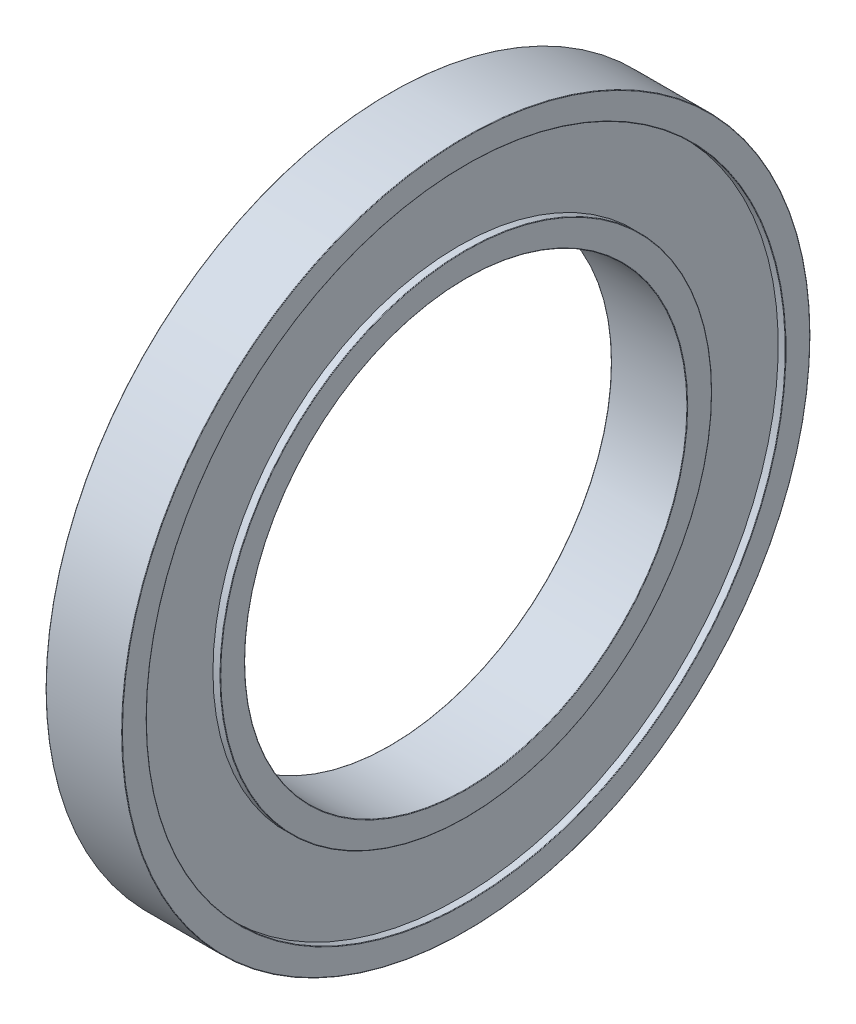
ISO-10303-21;
HEADER;
FILE_DESCRIPTION(('STEP AP214'),'2;1');
FILE_NAME('part.step','',(''),(''),'','','');
FILE_SCHEMA(('AUTOMOTIVE_DESIGN { 1 0 10303 214 1 1 1 1 }'));
ENDSEC;
DATA;
#1=APPLICATION_CONTEXT('core data for automotive mechanical design processes');
#2=APPLICATION_PROTOCOL_DEFINITION('international standard','automotive_design',2000,#1);
#3=PRODUCT_CONTEXT('',#1,'mechanical');
#4=PRODUCT('Part','Part','',(#3));
#5=PRODUCT_RELATED_PRODUCT_CATEGORY('part','',(#4));
#6=PRODUCT_DEFINITION_FORMATION('','',#4);
#7=PRODUCT_DEFINITION_CONTEXT('part definition',#1,'design');
#8=PRODUCT_DEFINITION('design','',#6,#7);
#9=PRODUCT_DEFINITION_SHAPE('','',#8);
#10=(LENGTH_UNIT() NAMED_UNIT(*) SI_UNIT(.MILLI.,.METRE.));
#11=(NAMED_UNIT(*) PLANE_ANGLE_UNIT() SI_UNIT($,.RADIAN.));
#12=(NAMED_UNIT(*) SI_UNIT($,.STERADIAN.) SOLID_ANGLE_UNIT());
#13=UNCERTAINTY_MEASURE_WITH_UNIT(LENGTH_MEASURE(1.E-05),#10,'distance_accuracy_value','');
#14=(GEOMETRIC_REPRESENTATION_CONTEXT(3) GLOBAL_UNCERTAINTY_ASSIGNED_CONTEXT((#13)) GLOBAL_UNIT_ASSIGNED_CONTEXT((#10,
#11,#12)) REPRESENTATION_CONTEXT('',''));
#15=CARTESIAN_POINT('',(0.,0.,0.));
#16=DIRECTION('',(0.,0.,1.));
#17=DIRECTION('',(1.,0.,0.));
#18=AXIS2_PLACEMENT_3D('',#15,#16,#17);
#19=CARTESIAN_POINT('',(0.,0.,0.));
#20=DIRECTION('',(-1.,0.,0.));
#21=DIRECTION('',(0.,0.,1.));
#22=AXIS2_PLACEMENT_3D('',#19,#20,#21);
#23=CYLINDRICAL_SURFACE('',#22,90.);
#24=CARTESIAN_POINT('',(0.2,0.,0.));
#25=DIRECTION('',(1.,0.,0.));
#26=DIRECTION('',(0.,0.,-1.));
#27=AXIS2_PLACEMENT_3D('',#24,#25,#26);
#28=CIRCLE('',#27,90.);
#29=CARTESIAN_POINT('',(0.2,0.,-90.));
#30=VERTEX_POINT('',#29);
#31=EDGE_CURVE('E65',#30,#30,#28,.F.);
#32=ORIENTED_EDGE('',*,*,#31,.T.);
#33=EDGE_LOOP('',(#32));
#34=FACE_BOUND('',#33,.T.);
#35=CARTESIAN_POINT('',(30.8,0.,0.));
#36=DIRECTION('',(-1.,0.,0.));
#37=DIRECTION('',(0.,0.,1.));
#38=AXIS2_PLACEMENT_3D('',#35,#36,#37);
#39=CIRCLE('',#38,90.);
#40=CARTESIAN_POINT('',(30.8,0.,90.));
#41=VERTEX_POINT('',#40);
#42=EDGE_CURVE('E68',#41,#41,#39,.F.);
#43=ORIENTED_EDGE('',*,*,#42,.T.);
#44=EDGE_LOOP('',(#43));
#45=FACE_BOUND('',#44,.T.);
#46=ADVANCED_FACE('F33',(#34,#45),#23,.F.);
#47=CARTESIAN_POINT('',(31.,100.,0.));
#48=DIRECTION('',(-1.,0.,0.));
#49=DIRECTION('',(0.,0.,1.));
#50=AXIS2_PLACEMENT_3D('',#47,#48,#49);
#51=PLANE('',#50);
#52=CARTESIAN_POINT('',(31.,0.,0.));
#53=DIRECTION('',(-1.,0.,0.));
#54=DIRECTION('',(0.,0.,1.));
#55=AXIS2_PLACEMENT_3D('',#52,#53,#54);
#56=CIRCLE('',#55,90.2);
#57=CARTESIAN_POINT('',(31.,0.,90.2));
#58=VERTEX_POINT('',#57);
#59=EDGE_CURVE('E59',#58,#58,#56,.T.);
#60=ORIENTED_EDGE('',*,*,#59,.T.);
#61=EDGE_LOOP('',(#60));
#62=FACE_BOUND('',#61,.T.);
#63=CARTESIAN_POINT('',(31.,0.,0.));
#64=DIRECTION('',(-1.,0.,0.));
#65=DIRECTION('',(0.,0.,1.));
#66=AXIS2_PLACEMENT_3D('',#63,#64,#65);
#67=CIRCLE('',#66,99.8);
#68=CARTESIAN_POINT('',(31.,0.,99.8));
#69=VERTEX_POINT('',#68);
#70=EDGE_CURVE('E62',#69,#69,#67,.F.);
#71=ORIENTED_EDGE('',*,*,#70,.T.);
#72=EDGE_LOOP('',(#71));
#73=FACE_BOUND('',#72,.T.);
#74=ADVANCED_FACE('F122',(#62,#73),#51,.F.);
#75=CARTESIAN_POINT('',(0.,0.,0.));
#76=DIRECTION('',(-1.,0.,0.));
#77=DIRECTION('',(0.,0.,1.));
#78=AXIS2_PLACEMENT_3D('',#75,#76,#77);
#79=CYLINDRICAL_SURFACE('',#78,100.);
#80=CARTESIAN_POINT('',(30.8,0.,0.));
#81=DIRECTION('',(-1.,0.,0.));
#82=DIRECTION('',(0.,0.,1.));
#83=AXIS2_PLACEMENT_3D('',#80,#81,#82);
#84=CIRCLE('',#83,100.);
#85=CARTESIAN_POINT('',(30.8,0.,100.));
#86=VERTEX_POINT('',#85);
#87=EDGE_CURVE('E56',#86,#86,#84,.T.);
#88=ORIENTED_EDGE('',*,*,#87,.T.);
#89=EDGE_LOOP('',(#88));
#90=FACE_BOUND('',#89,.T.);
#91=CARTESIAN_POINT('',(28.,0.,0.));
#92=DIRECTION('',(-1.,0.,0.));
#93=DIRECTION('',(0.,0.,1.));
#94=AXIS2_PLACEMENT_3D('',#91,#92,#93);
#95=CIRCLE('',#94,100.);
#96=CARTESIAN_POINT('',(28.,0.,100.));
#97=VERTEX_POINT('',#96);
#98=EDGE_CURVE('E89',#97,#97,#95,.T.);
#99=ORIENTED_EDGE('',*,*,#98,.F.);
#100=EDGE_LOOP('',(#99));
#101=FACE_BOUND('',#100,.T.);
#102=ADVANCED_FACE('F128',(#90,#101),#79,.T.);
#103=CARTESIAN_POINT('',(28.,130.,0.));
#104=DIRECTION('',(-1.,0.,0.));
#105=DIRECTION('',(0.,0.,1.));
#106=AXIS2_PLACEMENT_3D('',#103,#104,#105);
#107=PLANE('',#106);
#108=CARTESIAN_POINT('',(28.,0.,0.));
#109=DIRECTION('',(-1.,0.,0.));
#110=DIRECTION('',(0.,0.,1.));
#111=AXIS2_PLACEMENT_3D('',#108,#109,#110);
#112=CIRCLE('',#111,130.);
#113=CARTESIAN_POINT('',(28.,0.,130.));
#114=VERTEX_POINT('',#113);
#115=EDGE_CURVE('E92',#114,#114,#112,.T.);
#116=ORIENTED_EDGE('',*,*,#115,.F.);
#117=EDGE_LOOP('',(#116));
#118=FACE_BOUND('',#117,.T.);
#119=ORIENTED_EDGE('',*,*,#98,.T.);
#120=EDGE_LOOP('',(#119));
#121=FACE_BOUND('',#120,.T.);
#122=ADVANCED_FACE('F178',(#118,#121),#107,.F.);
#123=CARTESIAN_POINT('',(0.,0.,0.));
#124=DIRECTION('',(-1.,0.,0.));
#125=DIRECTION('',(0.,0.,1.));
#126=AXIS2_PLACEMENT_3D('',#123,#124,#125);
#127=CYLINDRICAL_SURFACE('',#126,130.);
#128=CARTESIAN_POINT('',(30.8,0.,0.));
#129=DIRECTION('',(-1.,0.,0.));
#130=DIRECTION('',(0.,0.,1.));
#131=AXIS2_PLACEMENT_3D('',#128,#129,#130);
#132=CIRCLE('',#131,130.);
#133=CARTESIAN_POINT('',(30.8,0.,130.));
#134=VERTEX_POINT('',#133);
#135=EDGE_CURVE('E44',#134,#134,#132,.F.);
#136=ORIENTED_EDGE('',*,*,#135,.T.);
#137=EDGE_LOOP('',(#136));
#138=FACE_BOUND('',#137,.T.);
#139=ORIENTED_EDGE('',*,*,#115,.T.);
#140=EDGE_LOOP('',(#139));
#141=FACE_BOUND('',#140,.T.);
#142=ADVANCED_FACE('F170',(#138,#141),#127,.F.);
#143=CARTESIAN_POINT('',(31.,140.,0.));
#144=DIRECTION('',(-1.,0.,0.));
#145=DIRECTION('',(0.,0.,1.));
#146=AXIS2_PLACEMENT_3D('',#143,#144,#145);
#147=PLANE('',#146);
#148=CARTESIAN_POINT('',(31.,0.,0.));
#149=DIRECTION('',(-1.,0.,0.));
#150=DIRECTION('',(0.,0.,1.));
#151=AXIS2_PLACEMENT_3D('',#148,#149,#150);
#152=CIRCLE('',#151,130.2);
#153=CARTESIAN_POINT('',(31.,0.,130.2));
#154=VERTEX_POINT('',#153);
#155=EDGE_CURVE('E48',#154,#154,#152,.T.);
#156=ORIENTED_EDGE('',*,*,#155,.T.);
#157=EDGE_LOOP('',(#156));
#158=FACE_BOUND('',#157,.T.);
#159=CARTESIAN_POINT('',(31.,0.,0.));
#160=DIRECTION('',(-1.,0.,0.));
#161=DIRECTION('',(0.,0.,1.));
#162=AXIS2_PLACEMENT_3D('',#159,#160,#161);
#163=CIRCLE('',#162,139.8);
#164=CARTESIAN_POINT('',(31.,0.,139.8));
#165=VERTEX_POINT('',#164);
#166=EDGE_CURVE('E53',#165,#165,#163,.F.);
#167=ORIENTED_EDGE('',*,*,#166,.T.);
#168=EDGE_LOOP('',(#167));
#169=FACE_BOUND('',#168,.T.);
#170=ADVANCED_FACE('F168',(#158,#169),#147,.F.);
#171=CARTESIAN_POINT('',(0.,0.,0.));
#172=DIRECTION('',(-1.,0.,0.));
#173=DIRECTION('',(0.,0.,1.));
#174=AXIS2_PLACEMENT_3D('',#171,#172,#173);
#175=CYLINDRICAL_SURFACE('',#174,140.);
#176=CARTESIAN_POINT('',(30.8,0.,0.));
#177=DIRECTION('',(-1.,0.,0.));
#178=DIRECTION('',(0.,0.,1.));
#179=AXIS2_PLACEMENT_3D('',#176,#177,#178);
#180=CIRCLE('',#179,140.);
#181=CARTESIAN_POINT('',(30.8,0.,140.));
#182=VERTEX_POINT('',#181);
#183=EDGE_CURVE('E10',#182,#182,#180,.T.);
#184=ORIENTED_EDGE('',*,*,#183,.T.);
#185=EDGE_LOOP('',(#184));
#186=FACE_BOUND('',#185,.T.);
#187=CARTESIAN_POINT('',(0.2,0.,0.));
#188=DIRECTION('',(1.,0.,0.));
#189=DIRECTION('',(0.,0.,-1.));
#190=AXIS2_PLACEMENT_3D('',#187,#188,#189);
#191=CIRCLE('',#190,140.);
#192=CARTESIAN_POINT('',(0.2,0.,-140.));
#193=VERTEX_POINT('',#192);
#194=EDGE_CURVE('E40',#193,#193,#191,.T.);
#195=ORIENTED_EDGE('',*,*,#194,.T.);
#196=EDGE_LOOP('',(#195));
#197=FACE_BOUND('',#196,.T.);
#198=ADVANCED_FACE('F118',(#186,#197),#175,.T.);
#199=CARTESIAN_POINT('',(0.,130.,0.));
#200=DIRECTION('',(1.,0.,0.));
#201=DIRECTION('',(0.,0.,-1.));
#202=AXIS2_PLACEMENT_3D('',#199,#200,#201);
#203=PLANE('',#202);
#204=CARTESIAN_POINT('',(0.,0.,0.));
#205=DIRECTION('',(1.,0.,0.));
#206=DIRECTION('',(0.,0.,-1.));
#207=AXIS2_PLACEMENT_3D('',#204,#205,#206);
#208=CIRCLE('',#207,130.2);
#209=CARTESIAN_POINT('',(0.,0.,-130.2));
#210=VERTEX_POINT('',#209);
#211=EDGE_CURVE('E80',#210,#210,#208,.T.);
#212=ORIENTED_EDGE('',*,*,#211,.T.);
#213=EDGE_LOOP('',(#212));
#214=FACE_BOUND('',#213,.T.);
#215=CARTESIAN_POINT('',(0.,0.,0.));
#216=DIRECTION('',(1.,0.,0.));
#217=DIRECTION('',(0.,0.,-1.));
#218=AXIS2_PLACEMENT_3D('',#215,#216,#217);
#219=CIRCLE('',#218,139.8);
#220=CARTESIAN_POINT('',(0.,0.,-139.8));
#221=VERTEX_POINT('',#220);
#222=EDGE_CURVE('E83',#221,#221,#219,.F.);
#223=ORIENTED_EDGE('',*,*,#222,.T.);
#224=EDGE_LOOP('',(#223));
#225=FACE_BOUND('',#224,.T.);
#226=ADVANCED_FACE('F112',(#214,#225),#203,.F.);
#227=CARTESIAN_POINT('',(0.,0.,0.));
#228=DIRECTION('',(-1.,0.,0.));
#229=DIRECTION('',(0.,0.,1.));
#230=AXIS2_PLACEMENT_3D('',#227,#228,#229);
#231=CYLINDRICAL_SURFACE('',#230,130.);
#232=CARTESIAN_POINT('',(0.2,0.,0.));
#233=DIRECTION('',(1.,0.,0.));
#234=DIRECTION('',(0.,0.,-1.));
#235=AXIS2_PLACEMENT_3D('',#232,#233,#234);
#236=CIRCLE('',#235,130.);
#237=CARTESIAN_POINT('',(0.2,0.,-130.));
#238=VERTEX_POINT('',#237);
#239=EDGE_CURVE('E86',#238,#238,#236,.F.);
#240=ORIENTED_EDGE('',*,*,#239,.T.);
#241=EDGE_LOOP('',(#240));
#242=FACE_BOUND('',#241,.T.);
#243=CARTESIAN_POINT('',(3.,0.,0.));
#244=DIRECTION('',(-1.,0.,0.));
#245=DIRECTION('',(0.,0.,1.));
#246=AXIS2_PLACEMENT_3D('',#243,#244,#245);
#247=CIRCLE('',#246,130.);
#248=CARTESIAN_POINT('',(3.,0.,130.));
#249=VERTEX_POINT('',#248);
#250=EDGE_CURVE('E95',#249,#249,#247,.T.);
#251=ORIENTED_EDGE('',*,*,#250,.F.);
#252=EDGE_LOOP('',(#251));
#253=FACE_BOUND('',#252,.T.);
#254=ADVANCED_FACE('F107',(#242,#253),#231,.F.);
#255=CARTESIAN_POINT('',(3.,130.,0.));
#256=DIRECTION('',(1.,0.,0.));
#257=DIRECTION('',(0.,0.,-1.));
#258=AXIS2_PLACEMENT_3D('',#255,#256,#257);
#259=PLANE('',#258);
#260=CARTESIAN_POINT('',(3.,0.,0.));
#261=DIRECTION('',(-1.,0.,0.));
#262=DIRECTION('',(0.,0.,1.));
#263=AXIS2_PLACEMENT_3D('',#260,#261,#262);
#264=CIRCLE('',#263,100.);
#265=CARTESIAN_POINT('',(3.,0.,100.));
#266=VERTEX_POINT('',#265);
#267=EDGE_CURVE('E98',#266,#266,#264,.T.);
#268=ORIENTED_EDGE('',*,*,#267,.F.);
#269=EDGE_LOOP('',(#268));
#270=FACE_BOUND('',#269,.T.);
#271=ORIENTED_EDGE('',*,*,#250,.T.);
#272=EDGE_LOOP('',(#271));
#273=FACE_BOUND('',#272,.T.);
#274=ADVANCED_FACE('F104',(#270,#273),#259,.F.);
#275=CARTESIAN_POINT('',(0.,0.,0.));
#276=DIRECTION('',(-1.,0.,0.));
#277=DIRECTION('',(0.,0.,1.));
#278=AXIS2_PLACEMENT_3D('',#275,#276,#277);
#279=CYLINDRICAL_SURFACE('',#278,100.);
#280=CARTESIAN_POINT('',(0.2,0.,0.));
#281=DIRECTION('',(1.,0.,0.));
#282=DIRECTION('',(0.,0.,-1.));
#283=AXIS2_PLACEMENT_3D('',#280,#281,#282);
#284=CIRCLE('',#283,100.);
#285=CARTESIAN_POINT('',(0.2,0.,-100.));
#286=VERTEX_POINT('',#285);
#287=EDGE_CURVE('E71',#286,#286,#284,.T.);
#288=ORIENTED_EDGE('',*,*,#287,.T.);
#289=EDGE_LOOP('',(#288));
#290=FACE_BOUND('',#289,.T.);
#291=ORIENTED_EDGE('',*,*,#267,.T.);
#292=EDGE_LOOP('',(#291));
#293=FACE_BOUND('',#292,.T.);
#294=ADVANCED_FACE('F102',(#290,#293),#279,.T.);
#295=CARTESIAN_POINT('',(0.,100.,0.));
#296=DIRECTION('',(1.,0.,0.));
#297=DIRECTION('',(0.,0.,-1.));
#298=AXIS2_PLACEMENT_3D('',#295,#296,#297);
#299=PLANE('',#298);
#300=CARTESIAN_POINT('',(0.,0.,0.));
#301=DIRECTION('',(1.,0.,0.));
#302=DIRECTION('',(0.,0.,-1.));
#303=AXIS2_PLACEMENT_3D('',#300,#301,#302);
#304=CIRCLE('',#303,99.8);
#305=CARTESIAN_POINT('',(0.,0.,-99.8));
#306=VERTEX_POINT('',#305);
#307=EDGE_CURVE('E74',#306,#306,#304,.F.);
#308=ORIENTED_EDGE('',*,*,#307,.T.);
#309=EDGE_LOOP('',(#308));
#310=FACE_BOUND('',#309,.T.);
#311=CARTESIAN_POINT('',(0.,0.,0.));
#312=DIRECTION('',(1.,0.,0.));
#313=DIRECTION('',(0.,0.,-1.));
#314=AXIS2_PLACEMENT_3D('',#311,#312,#313);
#315=CIRCLE('',#314,90.2);
#316=CARTESIAN_POINT('',(0.,0.,-90.2));
#317=VERTEX_POINT('',#316);
#318=EDGE_CURVE('E77',#317,#317,#315,.T.);
#319=ORIENTED_EDGE('',*,*,#318,.T.);
#320=EDGE_LOOP('',(#319));
#321=FACE_BOUND('',#320,.T.);
#322=ADVANCED_FACE('F138',(#310,#321),#299,.F.);
#323=CARTESIAN_POINT('',(0.2,0.,0.));
#324=DIRECTION('',(1.,0.,0.));
#325=DIRECTION('',(0.,0.,-1.));
#326=AXIS2_PLACEMENT_3D('',#323,#324,#325);
#327=TOROIDAL_SURFACE('',#326,130.2,0.2);
#328=ORIENTED_EDGE('',*,*,#211,.F.);
#329=EDGE_LOOP('',(#328));
#330=FACE_BOUND('',#329,.T.);
#331=ORIENTED_EDGE('',*,*,#239,.F.);
#332=EDGE_LOOP('',(#331));
#333=FACE_BOUND('',#332,.T.);
#334=ADVANCED_FACE('F134',(#330,#333),#327,.T.);
#335=CARTESIAN_POINT('',(0.2,0.,0.));
#336=DIRECTION('',(1.,0.,0.));
#337=DIRECTION('',(0.,0.,-1.));
#338=AXIS2_PLACEMENT_3D('',#335,#336,#337);
#339=TOROIDAL_SURFACE('',#338,99.8,0.2);
#340=ORIENTED_EDGE('',*,*,#287,.F.);
#341=EDGE_LOOP('',(#340));
#342=FACE_BOUND('',#341,.T.);
#343=ORIENTED_EDGE('',*,*,#307,.F.);
#344=EDGE_LOOP('',(#343));
#345=FACE_BOUND('',#344,.T.);
#346=ADVANCED_FACE('F137',(#342,#345),#339,.T.);
#347=CARTESIAN_POINT('',(0.2,0.,0.));
#348=DIRECTION('',(1.,0.,0.));
#349=DIRECTION('',(0.,0.,-1.));
#350=AXIS2_PLACEMENT_3D('',#347,#348,#349);
#351=TOROIDAL_SURFACE('',#350,90.2,0.2);
#352=ORIENTED_EDGE('',*,*,#318,.F.);
#353=EDGE_LOOP('',(#352));
#354=FACE_BOUND('',#353,.T.);
#355=ORIENTED_EDGE('',*,*,#31,.F.);
#356=EDGE_LOOP('',(#355));
#357=FACE_BOUND('',#356,.T.);
#358=ADVANCED_FACE('F142',(#354,#357),#351,.T.);
#359=CARTESIAN_POINT('',(30.8,0.,0.));
#360=DIRECTION('',(-1.,0.,0.));
#361=DIRECTION('',(0.,0.,1.));
#362=AXIS2_PLACEMENT_3D('',#359,#360,#361);
#363=TOROIDAL_SURFACE('',#362,90.2,0.2);
#364=ORIENTED_EDGE('',*,*,#42,.F.);
#365=EDGE_LOOP('',(#364));
#366=FACE_BOUND('',#365,.T.);
#367=ORIENTED_EDGE('',*,*,#59,.F.);
#368=EDGE_LOOP('',(#367));
#369=FACE_BOUND('',#368,.T.);
#370=ADVANCED_FACE('F146',(#366,#369),#363,.T.);
#371=CARTESIAN_POINT('',(30.8,0.,0.));
#372=DIRECTION('',(-1.,0.,0.));
#373=DIRECTION('',(0.,0.,1.));
#374=AXIS2_PLACEMENT_3D('',#371,#372,#373);
#375=TOROIDAL_SURFACE('',#374,99.8,0.2);
#376=ORIENTED_EDGE('',*,*,#70,.F.);
#377=EDGE_LOOP('',(#376));
#378=FACE_BOUND('',#377,.T.);
#379=ORIENTED_EDGE('',*,*,#87,.F.);
#380=EDGE_LOOP('',(#379));
#381=FACE_BOUND('',#380,.T.);
#382=ADVANCED_FACE('F150',(#378,#381),#375,.T.);
#383=CARTESIAN_POINT('',(30.8,0.,0.));
#384=DIRECTION('',(-1.,0.,0.));
#385=DIRECTION('',(0.,0.,1.));
#386=AXIS2_PLACEMENT_3D('',#383,#384,#385);
#387=TOROIDAL_SURFACE('',#386,130.2,0.2);
#388=ORIENTED_EDGE('',*,*,#135,.F.);
#389=EDGE_LOOP('',(#388));
#390=FACE_BOUND('',#389,.T.);
#391=ORIENTED_EDGE('',*,*,#155,.F.);
#392=EDGE_LOOP('',(#391));
#393=FACE_BOUND('',#392,.T.);
#394=ADVANCED_FACE('F154',(#390,#393),#387,.T.);
#395=CARTESIAN_POINT('',(30.8,0.,0.));
#396=DIRECTION('',(-1.,0.,0.));
#397=DIRECTION('',(0.,0.,1.));
#398=AXIS2_PLACEMENT_3D('',#395,#396,#397);
#399=TOROIDAL_SURFACE('',#398,139.8,0.2);
#400=ORIENTED_EDGE('',*,*,#166,.F.);
#401=EDGE_LOOP('',(#400));
#402=FACE_BOUND('',#401,.T.);
#403=ORIENTED_EDGE('',*,*,#183,.F.);
#404=EDGE_LOOP('',(#403));
#405=FACE_BOUND('',#404,.T.);
#406=ADVANCED_FACE('F157',(#402,#405),#399,.T.);
#407=CARTESIAN_POINT('',(0.2,0.,0.));
#408=DIRECTION('',(1.,0.,0.));
#409=DIRECTION('',(0.,0.,-1.));
#410=AXIS2_PLACEMENT_3D('',#407,#408,#409);
#411=TOROIDAL_SURFACE('',#410,139.8,0.2);
#412=ORIENTED_EDGE('',*,*,#194,.F.);
#413=EDGE_LOOP('',(#412));
#414=FACE_BOUND('',#413,.T.);
#415=ORIENTED_EDGE('',*,*,#222,.F.);
#416=EDGE_LOOP('',(#415));
#417=FACE_BOUND('',#416,.T.);
#418=ADVANCED_FACE('F35',(#414,#417),#411,.T.);
#419=CLOSED_SHELL('',(#46,#74,#102,#122,#142,#170,#198,#226,#254,#274,#294,#322,#334,#346,#358,
#370,#382,#394,#406,#418));
#420=MANIFOLD_SOLID_BREP('B2',#419);
#421=ADVANCED_BREP_SHAPE_REPRESENTATION('',(#18,#420),#14);
#422=SHAPE_DEFINITION_REPRESENTATION(#9,#421);
ENDSEC;
END-ISO-10303-21;
